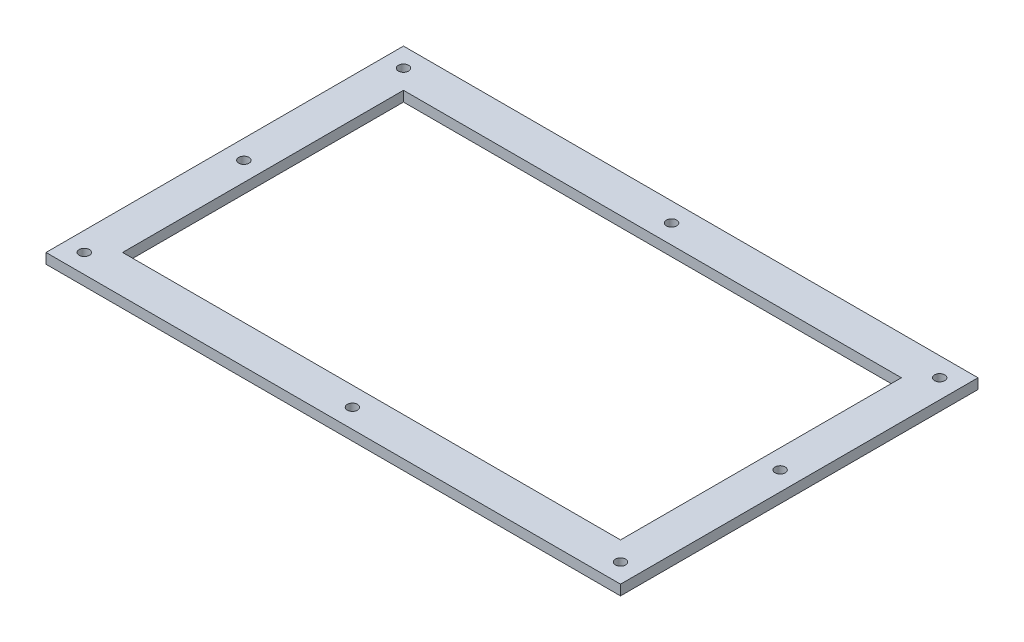
ISO-10303-21;
HEADER;
FILE_DESCRIPTION(('STEP AP214'),'2;1');
FILE_NAME('part.step','',(''),(''),'','','');
FILE_SCHEMA(('AUTOMOTIVE_DESIGN { 1 0 10303 214 1 1 1 1 }'));
ENDSEC;
DATA;
#1=APPLICATION_CONTEXT('core data for automotive mechanical design processes');
#2=APPLICATION_PROTOCOL_DEFINITION('international standard','automotive_design',2000,#1);
#3=PRODUCT_CONTEXT('',#1,'mechanical');
#4=PRODUCT('Part','Part','',(#3));
#5=PRODUCT_RELATED_PRODUCT_CATEGORY('part','',(#4));
#6=PRODUCT_DEFINITION_FORMATION('','',#4);
#7=PRODUCT_DEFINITION_CONTEXT('part definition',#1,'design');
#8=PRODUCT_DEFINITION('design','',#6,#7);
#9=PRODUCT_DEFINITION_SHAPE('','',#8);
#10=(LENGTH_UNIT() NAMED_UNIT(*) SI_UNIT(.MILLI.,.METRE.));
#11=(NAMED_UNIT(*) PLANE_ANGLE_UNIT() SI_UNIT($,.RADIAN.));
#12=(NAMED_UNIT(*) SI_UNIT($,.STERADIAN.) SOLID_ANGLE_UNIT());
#13=UNCERTAINTY_MEASURE_WITH_UNIT(LENGTH_MEASURE(1.E-05),#10,'distance_accuracy_value','');
#14=(GEOMETRIC_REPRESENTATION_CONTEXT(3) GLOBAL_UNCERTAINTY_ASSIGNED_CONTEXT((#13)) GLOBAL_UNIT_ASSIGNED_CONTEXT((#10,
#11,#12)) REPRESENTATION_CONTEXT('',''));
#15=CARTESIAN_POINT('',(0.,0.,0.));
#16=DIRECTION('',(0.,0.,1.));
#17=DIRECTION('',(1.,0.,0.));
#18=AXIS2_PLACEMENT_3D('',#15,#16,#17);
#19=CARTESIAN_POINT('',(0.,4.,0.));
#20=DIRECTION('',(0.,-1.,0.));
#21=DIRECTION('',(0.,0.,-1.));
#22=AXIS2_PLACEMENT_3D('',#19,#20,#21);
#23=PLANE('',#22);
#24=CARTESIAN_POINT('',(27.5,4.,-62.5));
#25=DIRECTION('',(0.,1.,0.));
#26=DIRECTION('',(0.,0.,1.));
#27=AXIS2_PLACEMENT_3D('',#24,#25,#26);
#28=CIRCLE('',#27,2.);
#29=CARTESIAN_POINT('',(27.5,4.,-60.5));
#30=VERTEX_POINT('',#29);
#31=EDGE_CURVE('E281',#30,#30,#28,.T.);
#32=ORIENTED_EDGE('',*,*,#31,.F.);
#33=EDGE_LOOP('',(#32));
#34=FACE_BOUND('',#33,.T.);
#35=DIRECTION('',(0.,0.,1.));
#36=VECTOR('',#35,1.);
#37=CARTESIAN_POINT('',(-85.,4.,70.));
#38=LINE('',#37,#36);
#39=CARTESIAN_POINT('',(-85.,4.,-70.));
#40=VERTEX_POINT('',#39);
#41=CARTESIAN_POINT('',(-85.,4.,70.));
#42=VERTEX_POINT('',#41);
#43=EDGE_CURVE('E268',#40,#42,#38,.T.);
#44=ORIENTED_EDGE('',*,*,#43,.T.);
#45=DIRECTION('',(1.,0.,0.));
#46=VECTOR('',#45,1.);
#47=CARTESIAN_POINT('',(-85.,4.,70.));
#48=LINE('',#47,#46);
#49=CARTESIAN_POINT('',(140.,4.,70.));
#50=VERTEX_POINT('',#49);
#51=EDGE_CURVE('E293',#42,#50,#48,.T.);
#52=ORIENTED_EDGE('',*,*,#51,.T.);
#53=DIRECTION('',(0.,0.,-1.));
#54=VECTOR('',#53,1.);
#55=CARTESIAN_POINT('',(140.,4.,70.));
#56=LINE('',#55,#54);
#57=CARTESIAN_POINT('',(140.,4.,-70.));
#58=VERTEX_POINT('',#57);
#59=EDGE_CURVE('E260',#50,#58,#56,.T.);
#60=ORIENTED_EDGE('',*,*,#59,.T.);
#61=DIRECTION('',(-1.,0.,0.));
#62=VECTOR('',#61,1.);
#63=CARTESIAN_POINT('',(-85.,4.,-70.));
#64=LINE('',#63,#62);
#65=EDGE_CURVE('E302',#58,#40,#64,.T.);
#66=ORIENTED_EDGE('',*,*,#65,.T.);
#67=EDGE_LOOP('',(#44,#52,#60,#66));
#68=FACE_BOUND('',#67,.T.);
#69=DIRECTION('',(0.,0.,1.));
#70=VECTOR('',#69,1.);
#71=CARTESIAN_POINT('',(-70.,4.,-55.));
#72=LINE('',#71,#70);
#73=CARTESIAN_POINT('',(-70.,4.,-55.));
#74=VERTEX_POINT('',#73);
#75=CARTESIAN_POINT('',(-70.,4.,55.));
#76=VERTEX_POINT('',#75);
#77=EDGE_CURVE('E106',#74,#76,#72,.T.);
#78=ORIENTED_EDGE('',*,*,#77,.F.);
#79=DIRECTION('',(-1.,0.,0.));
#80=VECTOR('',#79,1.);
#81=CARTESIAN_POINT('',(-70.,4.,-55.));
#82=LINE('',#81,#80);
#83=CARTESIAN_POINT('',(125.,4.,-55.));
#84=VERTEX_POINT('',#83);
#85=EDGE_CURVE('E133',#84,#74,#82,.T.);
#86=ORIENTED_EDGE('',*,*,#85,.F.);
#87=DIRECTION('',(0.,0.,-1.));
#88=VECTOR('',#87,1.);
#89=CARTESIAN_POINT('',(125.,4.,-55.));
#90=LINE('',#89,#88);
#91=CARTESIAN_POINT('',(125.,4.,55.));
#92=VERTEX_POINT('',#91);
#93=EDGE_CURVE('E129',#92,#84,#90,.T.);
#94=ORIENTED_EDGE('',*,*,#93,.F.);
#95=DIRECTION('',(1.,0.,0.));
#96=VECTOR('',#95,1.);
#97=CARTESIAN_POINT('',(-70.,4.,55.));
#98=LINE('',#97,#96);
#99=EDGE_CURVE('E115',#76,#92,#98,.T.);
#100=ORIENTED_EDGE('',*,*,#99,.F.);
#101=EDGE_LOOP('',(#78,#86,#94,#100));
#102=FACE_BOUND('',#101,.T.);
#103=CARTESIAN_POINT('',(132.5,4.,-62.5));
#104=DIRECTION('',(0.,1.,0.));
#105=DIRECTION('',(0.,0.,1.));
#106=AXIS2_PLACEMENT_3D('',#103,#104,#105);
#107=CIRCLE('',#106,2.);
#108=CARTESIAN_POINT('',(132.5,4.,-60.5));
#109=VERTEX_POINT('',#108);
#110=EDGE_CURVE('E148',#109,#109,#107,.T.);
#111=ORIENTED_EDGE('',*,*,#110,.F.);
#112=EDGE_LOOP('',(#111));
#113=FACE_BOUND('',#112,.T.);
#114=CARTESIAN_POINT('',(-77.5,4.,0.));
#115=DIRECTION('',(0.,1.,0.));
#116=DIRECTION('',(0.,0.,1.));
#117=AXIS2_PLACEMENT_3D('',#114,#115,#116);
#118=CIRCLE('',#117,2.);
#119=CARTESIAN_POINT('',(-77.5,4.,2.));
#120=VERTEX_POINT('',#119);
#121=EDGE_CURVE('E157',#120,#120,#118,.T.);
#122=ORIENTED_EDGE('',*,*,#121,.F.);
#123=EDGE_LOOP('',(#122));
#124=FACE_BOUND('',#123,.T.);
#125=CARTESIAN_POINT('',(-77.5,4.,62.5));
#126=DIRECTION('',(0.,1.,0.));
#127=DIRECTION('',(0.,0.,1.));
#128=AXIS2_PLACEMENT_3D('',#125,#126,#127);
#129=CIRCLE('',#128,2.);
#130=CARTESIAN_POINT('',(-77.5,4.,64.5));
#131=VERTEX_POINT('',#130);
#132=EDGE_CURVE('E166',#131,#131,#129,.T.);
#133=ORIENTED_EDGE('',*,*,#132,.F.);
#134=EDGE_LOOP('',(#133));
#135=FACE_BOUND('',#134,.T.);
#136=CARTESIAN_POINT('',(132.5,4.,62.5));
#137=DIRECTION('',(0.,1.,0.));
#138=DIRECTION('',(0.,0.,1.));
#139=AXIS2_PLACEMENT_3D('',#136,#137,#138);
#140=CIRCLE('',#139,2.);
#141=CARTESIAN_POINT('',(132.5,4.,64.5));
#142=VERTEX_POINT('',#141);
#143=EDGE_CURVE('E173',#142,#142,#140,.T.);
#144=ORIENTED_EDGE('',*,*,#143,.F.);
#145=EDGE_LOOP('',(#144));
#146=FACE_BOUND('',#145,.T.);
#147=CARTESIAN_POINT('',(132.5,4.,0.));
#148=DIRECTION('',(0.,1.,0.));
#149=DIRECTION('',(0.,0.,1.));
#150=AXIS2_PLACEMENT_3D('',#147,#148,#149);
#151=CIRCLE('',#150,2.);
#152=CARTESIAN_POINT('',(132.5,4.,2.));
#153=VERTEX_POINT('',#152);
#154=EDGE_CURVE('E190',#153,#153,#151,.T.);
#155=ORIENTED_EDGE('',*,*,#154,.F.);
#156=EDGE_LOOP('',(#155));
#157=FACE_BOUND('',#156,.T.);
#158=CARTESIAN_POINT('',(27.5,4.,62.5));
#159=DIRECTION('',(0.,1.,0.));
#160=DIRECTION('',(0.,0.,1.));
#161=AXIS2_PLACEMENT_3D('',#158,#159,#160);
#162=CIRCLE('',#161,2.);
#163=CARTESIAN_POINT('',(27.5,4.,64.5));
#164=VERTEX_POINT('',#163);
#165=EDGE_CURVE('E191',#164,#164,#162,.T.);
#166=ORIENTED_EDGE('',*,*,#165,.F.);
#167=EDGE_LOOP('',(#166));
#168=FACE_BOUND('',#167,.T.);
#169=CARTESIAN_POINT('',(-77.5,4.,-62.5));
#170=DIRECTION('',(0.,1.,0.));
#171=DIRECTION('',(0.,0.,1.));
#172=AXIS2_PLACEMENT_3D('',#169,#170,#171);
#173=CIRCLE('',#172,2.);
#174=CARTESIAN_POINT('',(-77.5,4.,-60.5));
#175=VERTEX_POINT('',#174);
#176=EDGE_CURVE('E200',#175,#175,#173,.T.);
#177=ORIENTED_EDGE('',*,*,#176,.F.);
#178=EDGE_LOOP('',(#177));
#179=FACE_BOUND('',#178,.T.);
#180=ADVANCED_FACE('F40',(#34,#68,#102,#113,#124,#135,#146,#157,#168,#179),#23,.F.);
#181=CARTESIAN_POINT('',(0.,0.,0.));
#182=DIRECTION('',(0.,-1.,0.));
#183=DIRECTION('',(0.,0.,-1.));
#184=AXIS2_PLACEMENT_3D('',#181,#182,#183);
#185=PLANE('',#184);
#186=CARTESIAN_POINT('',(27.5,0.,62.5));
#187=DIRECTION('',(0.,1.,0.));
#188=DIRECTION('',(0.,0.,1.));
#189=AXIS2_PLACEMENT_3D('',#186,#187,#188);
#190=CIRCLE('',#189,2.);
#191=CARTESIAN_POINT('',(27.5,0.,64.5));
#192=VERTEX_POINT('',#191);
#193=EDGE_CURVE('E196',#192,#192,#190,.T.);
#194=ORIENTED_EDGE('',*,*,#193,.T.);
#195=EDGE_LOOP('',(#194));
#196=FACE_BOUND('',#195,.T.);
#197=CARTESIAN_POINT('',(132.5,0.,62.5));
#198=DIRECTION('',(0.,1.,0.));
#199=DIRECTION('',(0.,0.,1.));
#200=AXIS2_PLACEMENT_3D('',#197,#198,#199);
#201=CIRCLE('',#200,2.);
#202=CARTESIAN_POINT('',(132.5,0.,64.5));
#203=VERTEX_POINT('',#202);
#204=EDGE_CURVE('E178',#203,#203,#201,.T.);
#205=ORIENTED_EDGE('',*,*,#204,.T.);
#206=EDGE_LOOP('',(#205));
#207=FACE_BOUND('',#206,.T.);
#208=CARTESIAN_POINT('',(-77.5,0.,0.));
#209=DIRECTION('',(0.,1.,0.));
#210=DIRECTION('',(0.,0.,1.));
#211=AXIS2_PLACEMENT_3D('',#208,#209,#210);
#212=CIRCLE('',#211,2.);
#213=CARTESIAN_POINT('',(-77.5,0.,2.));
#214=VERTEX_POINT('',#213);
#215=EDGE_CURVE('E154',#214,#214,#212,.T.);
#216=ORIENTED_EDGE('',*,*,#215,.T.);
#217=EDGE_LOOP('',(#216));
#218=FACE_BOUND('',#217,.T.);
#219=DIRECTION('',(-1.,0.,0.));
#220=VECTOR('',#219,1.);
#221=CARTESIAN_POINT('',(-70.,0.,-55.));
#222=LINE('',#221,#220);
#223=CARTESIAN_POINT('',(125.,0.,-55.));
#224=VERTEX_POINT('',#223);
#225=CARTESIAN_POINT('',(-70.,0.,-55.));
#226=VERTEX_POINT('',#225);
#227=EDGE_CURVE('E116',#224,#226,#222,.T.);
#228=ORIENTED_EDGE('',*,*,#227,.T.);
#229=DIRECTION('',(0.,0.,1.));
#230=VECTOR('',#229,1.);
#231=CARTESIAN_POINT('',(-70.,0.,-55.));
#232=LINE('',#231,#230);
#233=CARTESIAN_POINT('',(-70.,0.,55.));
#234=VERTEX_POINT('',#233);
#235=EDGE_CURVE('E64',#226,#234,#232,.T.);
#236=ORIENTED_EDGE('',*,*,#235,.T.);
#237=DIRECTION('',(1.,0.,0.));
#238=VECTOR('',#237,1.);
#239=CARTESIAN_POINT('',(-70.,0.,55.));
#240=LINE('',#239,#238);
#241=CARTESIAN_POINT('',(125.,0.,55.));
#242=VERTEX_POINT('',#241);
#243=EDGE_CURVE('E122',#234,#242,#240,.T.);
#244=ORIENTED_EDGE('',*,*,#243,.T.);
#245=DIRECTION('',(0.,0.,-1.));
#246=VECTOR('',#245,1.);
#247=CARTESIAN_POINT('',(125.,0.,-55.));
#248=LINE('',#247,#246);
#249=EDGE_CURVE('E325',#242,#224,#248,.T.);
#250=ORIENTED_EDGE('',*,*,#249,.T.);
#251=EDGE_LOOP('',(#228,#236,#244,#250));
#252=FACE_BOUND('',#251,.T.);
#253=CARTESIAN_POINT('',(27.5,0.,-62.5));
#254=DIRECTION('',(0.,1.,0.));
#255=DIRECTION('',(0.,0.,1.));
#256=AXIS2_PLACEMENT_3D('',#253,#254,#255);
#257=CIRCLE('',#256,2.);
#258=CARTESIAN_POINT('',(27.5,0.,-60.5));
#259=VERTEX_POINT('',#258);
#260=EDGE_CURVE('E124',#259,#259,#257,.T.);
#261=ORIENTED_EDGE('',*,*,#260,.T.);
#262=EDGE_LOOP('',(#261));
#263=FACE_BOUND('',#262,.T.);
#264=DIRECTION('',(0.,0.,1.));
#265=VECTOR('',#264,1.);
#266=CARTESIAN_POINT('',(-85.,0.,70.));
#267=LINE('',#266,#265);
#268=CARTESIAN_POINT('',(-85.,0.,-70.));
#269=VERTEX_POINT('',#268);
#270=CARTESIAN_POINT('',(-85.,0.,70.));
#271=VERTEX_POINT('',#270);
#272=EDGE_CURVE('E256',#269,#271,#267,.T.);
#273=ORIENTED_EDGE('',*,*,#272,.F.);
#274=DIRECTION('',(-1.,0.,0.));
#275=VECTOR('',#274,1.);
#276=CARTESIAN_POINT('',(-85.,0.,-70.));
#277=LINE('',#276,#275);
#278=CARTESIAN_POINT('',(140.,0.,-70.));
#279=VERTEX_POINT('',#278);
#280=EDGE_CURVE('E264',#279,#269,#277,.T.);
#281=ORIENTED_EDGE('',*,*,#280,.F.);
#282=DIRECTION('',(0.,0.,-1.));
#283=VECTOR('',#282,1.);
#284=CARTESIAN_POINT('',(140.,0.,70.));
#285=LINE('',#284,#283);
#286=CARTESIAN_POINT('',(140.,0.,70.));
#287=VERTEX_POINT('',#286);
#288=EDGE_CURVE('E255',#287,#279,#285,.T.);
#289=ORIENTED_EDGE('',*,*,#288,.F.);
#290=DIRECTION('',(1.,0.,0.));
#291=VECTOR('',#290,1.);
#292=CARTESIAN_POINT('',(-85.,0.,70.));
#293=LINE('',#292,#291);
#294=EDGE_CURVE('E246',#271,#287,#293,.T.);
#295=ORIENTED_EDGE('',*,*,#294,.F.);
#296=EDGE_LOOP('',(#273,#281,#289,#295));
#297=FACE_BOUND('',#296,.T.);
#298=CARTESIAN_POINT('',(132.5,0.,-62.5));
#299=DIRECTION('',(0.,1.,0.));
#300=DIRECTION('',(0.,0.,1.));
#301=AXIS2_PLACEMENT_3D('',#298,#299,#300);
#302=CIRCLE('',#301,2.);
#303=CARTESIAN_POINT('',(132.5,0.,-60.5));
#304=VERTEX_POINT('',#303);
#305=EDGE_CURVE('E153',#304,#304,#302,.T.);
#306=ORIENTED_EDGE('',*,*,#305,.T.);
#307=EDGE_LOOP('',(#306));
#308=FACE_BOUND('',#307,.T.);
#309=CARTESIAN_POINT('',(-77.5,0.,62.5));
#310=DIRECTION('',(0.,1.,0.));
#311=DIRECTION('',(0.,0.,1.));
#312=AXIS2_PLACEMENT_3D('',#309,#310,#311);
#313=CIRCLE('',#312,2.);
#314=CARTESIAN_POINT('',(-77.5,0.,64.5));
#315=VERTEX_POINT('',#314);
#316=EDGE_CURVE('E169',#315,#315,#313,.T.);
#317=ORIENTED_EDGE('',*,*,#316,.T.);
#318=EDGE_LOOP('',(#317));
#319=FACE_BOUND('',#318,.T.);
#320=CARTESIAN_POINT('',(132.5,0.,0.));
#321=DIRECTION('',(0.,1.,0.));
#322=DIRECTION('',(0.,0.,1.));
#323=AXIS2_PLACEMENT_3D('',#320,#321,#322);
#324=CIRCLE('',#323,2.);
#325=CARTESIAN_POINT('',(132.5,0.,2.));
#326=VERTEX_POINT('',#325);
#327=EDGE_CURVE('E187',#326,#326,#324,.T.);
#328=ORIENTED_EDGE('',*,*,#327,.T.);
#329=EDGE_LOOP('',(#328));
#330=FACE_BOUND('',#329,.T.);
#331=CARTESIAN_POINT('',(-77.5,0.,-62.5));
#332=DIRECTION('',(0.,1.,0.));
#333=DIRECTION('',(0.,0.,1.));
#334=AXIS2_PLACEMENT_3D('',#331,#332,#333);
#335=CIRCLE('',#334,2.);
#336=CARTESIAN_POINT('',(-77.5,0.,-60.5));
#337=VERTEX_POINT('',#336);
#338=EDGE_CURVE('E205',#337,#337,#335,.T.);
#339=ORIENTED_EDGE('',*,*,#338,.T.);
#340=EDGE_LOOP('',(#339));
#341=FACE_BOUND('',#340,.T.);
#342=ADVANCED_FACE('F217',(#196,#207,#218,#252,#263,#297,#308,#319,#330,#341),#185,.T.);
#343=CARTESIAN_POINT('',(-85.,4.,70.));
#344=DIRECTION('',(1.,0.,0.));
#345=DIRECTION('',(0.,0.,-1.));
#346=AXIS2_PLACEMENT_3D('',#343,#344,#345);
#347=PLANE('',#346);
#348=ORIENTED_EDGE('',*,*,#272,.T.);
#349=DIRECTION('',(0.,-1.,0.));
#350=VECTOR('',#349,1.);
#351=CARTESIAN_POINT('',(-85.,4.,70.));
#352=LINE('',#351,#350);
#353=EDGE_CURVE('E12',#42,#271,#352,.T.);
#354=ORIENTED_EDGE('',*,*,#353,.F.);
#355=ORIENTED_EDGE('',*,*,#43,.F.);
#356=DIRECTION('',(0.,-1.,0.));
#357=VECTOR('',#356,1.);
#358=CARTESIAN_POINT('',(-85.,4.,-70.));
#359=LINE('',#358,#357);
#360=EDGE_CURVE('E273',#40,#269,#359,.T.);
#361=ORIENTED_EDGE('',*,*,#360,.T.);
#362=EDGE_LOOP('',(#348,#354,#355,#361));
#363=FACE_BOUND('',#362,.T.);
#364=ADVANCED_FACE('F42',(#363),#347,.F.);
#365=CARTESIAN_POINT('',(-85.,4.,70.));
#366=DIRECTION('',(0.,0.,-1.));
#367=DIRECTION('',(-1.,0.,0.));
#368=AXIS2_PLACEMENT_3D('',#365,#366,#367);
#369=PLANE('',#368);
#370=ORIENTED_EDGE('',*,*,#294,.T.);
#371=DIRECTION('',(0.,-1.,0.));
#372=VECTOR('',#371,1.);
#373=CARTESIAN_POINT('',(140.,4.,70.));
#374=LINE('',#373,#372);
#375=EDGE_CURVE('E49',#50,#287,#374,.T.);
#376=ORIENTED_EDGE('',*,*,#375,.F.);
#377=ORIENTED_EDGE('',*,*,#51,.F.);
#378=ORIENTED_EDGE('',*,*,#353,.T.);
#379=EDGE_LOOP('',(#370,#376,#377,#378));
#380=FACE_BOUND('',#379,.T.);
#381=ADVANCED_FACE('F237',(#380),#369,.F.);
#382=CARTESIAN_POINT('',(140.,4.,70.));
#383=DIRECTION('',(-1.,0.,0.));
#384=DIRECTION('',(0.,0.,1.));
#385=AXIS2_PLACEMENT_3D('',#382,#383,#384);
#386=PLANE('',#385);
#387=ORIENTED_EDGE('',*,*,#288,.T.);
#388=DIRECTION('',(0.,-1.,0.));
#389=VECTOR('',#388,1.);
#390=CARTESIAN_POINT('',(140.,4.,-70.));
#391=LINE('',#390,#389);
#392=EDGE_CURVE('E262',#58,#279,#391,.T.);
#393=ORIENTED_EDGE('',*,*,#392,.F.);
#394=ORIENTED_EDGE('',*,*,#59,.F.);
#395=ORIENTED_EDGE('',*,*,#375,.T.);
#396=EDGE_LOOP('',(#387,#393,#394,#395));
#397=FACE_BOUND('',#396,.T.);
#398=ADVANCED_FACE('F234',(#397),#386,.F.);
#399=CARTESIAN_POINT('',(-85.,4.,-70.));
#400=DIRECTION('',(0.,0.,1.));
#401=DIRECTION('',(1.,0.,0.));
#402=AXIS2_PLACEMENT_3D('',#399,#400,#401);
#403=PLANE('',#402);
#404=ORIENTED_EDGE('',*,*,#280,.T.);
#405=ORIENTED_EDGE('',*,*,#360,.F.);
#406=ORIENTED_EDGE('',*,*,#65,.F.);
#407=ORIENTED_EDGE('',*,*,#392,.T.);
#408=EDGE_LOOP('',(#404,#405,#406,#407));
#409=FACE_BOUND('',#408,.T.);
#410=ADVANCED_FACE('F231',(#409),#403,.F.);
#411=CARTESIAN_POINT('',(27.5,4.,-62.5));
#412=DIRECTION('',(0.,-1.,0.));
#413=DIRECTION('',(0.,0.,-1.));
#414=AXIS2_PLACEMENT_3D('',#411,#412,#413);
#415=CYLINDRICAL_SURFACE('',#414,2.);
#416=ORIENTED_EDGE('',*,*,#31,.T.);
#417=EDGE_LOOP('',(#416));
#418=FACE_BOUND('',#417,.T.);
#419=ORIENTED_EDGE('',*,*,#260,.F.);
#420=EDGE_LOOP('',(#419));
#421=FACE_BOUND('',#420,.T.);
#422=ADVANCED_FACE('F228',(#418,#421),#415,.F.);
#423=CARTESIAN_POINT('',(-70.,4.,-55.));
#424=DIRECTION('',(1.,0.,0.));
#425=DIRECTION('',(0.,0.,-1.));
#426=AXIS2_PLACEMENT_3D('',#423,#424,#425);
#427=PLANE('',#426);
#428=ORIENTED_EDGE('',*,*,#235,.F.);
#429=DIRECTION('',(0.,-1.,0.));
#430=VECTOR('',#429,1.);
#431=CARTESIAN_POINT('',(-70.,4.,-55.));
#432=LINE('',#431,#430);
#433=EDGE_CURVE('E110',#74,#226,#432,.T.);
#434=ORIENTED_EDGE('',*,*,#433,.F.);
#435=ORIENTED_EDGE('',*,*,#77,.T.);
#436=DIRECTION('',(0.,-1.,0.));
#437=VECTOR('',#436,1.);
#438=CARTESIAN_POINT('',(-70.,4.,55.));
#439=LINE('',#438,#437);
#440=EDGE_CURVE('E109',#76,#234,#439,.T.);
#441=ORIENTED_EDGE('',*,*,#440,.T.);
#442=EDGE_LOOP('',(#428,#434,#435,#441));
#443=FACE_BOUND('',#442,.T.);
#444=ADVANCED_FACE('F108',(#443),#427,.T.);
#445=CARTESIAN_POINT('',(-70.,4.,55.));
#446=DIRECTION('',(0.,0.,-1.));
#447=DIRECTION('',(-1.,0.,0.));
#448=AXIS2_PLACEMENT_3D('',#445,#446,#447);
#449=PLANE('',#448);
#450=ORIENTED_EDGE('',*,*,#243,.F.);
#451=ORIENTED_EDGE('',*,*,#440,.F.);
#452=ORIENTED_EDGE('',*,*,#99,.T.);
#453=DIRECTION('',(0.,-1.,0.));
#454=VECTOR('',#453,1.);
#455=CARTESIAN_POINT('',(125.,4.,55.));
#456=LINE('',#455,#454);
#457=EDGE_CURVE('E125',#92,#242,#456,.T.);
#458=ORIENTED_EDGE('',*,*,#457,.T.);
#459=EDGE_LOOP('',(#450,#451,#452,#458));
#460=FACE_BOUND('',#459,.T.);
#461=ADVANCED_FACE('F119',(#460),#449,.T.);
#462=CARTESIAN_POINT('',(125.,4.,-55.));
#463=DIRECTION('',(-1.,0.,0.));
#464=DIRECTION('',(0.,0.,1.));
#465=AXIS2_PLACEMENT_3D('',#462,#463,#464);
#466=PLANE('',#465);
#467=ORIENTED_EDGE('',*,*,#249,.F.);
#468=ORIENTED_EDGE('',*,*,#457,.F.);
#469=ORIENTED_EDGE('',*,*,#93,.T.);
#470=DIRECTION('',(0.,-1.,0.));
#471=VECTOR('',#470,1.);
#472=CARTESIAN_POINT('',(125.,4.,-55.));
#473=LINE('',#472,#471);
#474=EDGE_CURVE('E56',#84,#224,#473,.T.);
#475=ORIENTED_EDGE('',*,*,#474,.T.);
#476=EDGE_LOOP('',(#467,#468,#469,#475));
#477=FACE_BOUND('',#476,.T.);
#478=ADVANCED_FACE('F337',(#477),#466,.T.);
#479=CARTESIAN_POINT('',(-70.,4.,-55.));
#480=DIRECTION('',(0.,0.,1.));
#481=DIRECTION('',(1.,0.,0.));
#482=AXIS2_PLACEMENT_3D('',#479,#480,#481);
#483=PLANE('',#482);
#484=ORIENTED_EDGE('',*,*,#227,.F.);
#485=ORIENTED_EDGE('',*,*,#474,.F.);
#486=ORIENTED_EDGE('',*,*,#85,.T.);
#487=ORIENTED_EDGE('',*,*,#433,.T.);
#488=EDGE_LOOP('',(#484,#485,#486,#487));
#489=FACE_BOUND('',#488,.T.);
#490=ADVANCED_FACE('F334',(#489),#483,.T.);
#491=CARTESIAN_POINT('',(132.5,4.,-62.5));
#492=DIRECTION('',(0.,-1.,0.));
#493=DIRECTION('',(0.,0.,-1.));
#494=AXIS2_PLACEMENT_3D('',#491,#492,#493);
#495=CYLINDRICAL_SURFACE('',#494,2.);
#496=ORIENTED_EDGE('',*,*,#110,.T.);
#497=EDGE_LOOP('',(#496));
#498=FACE_BOUND('',#497,.T.);
#499=ORIENTED_EDGE('',*,*,#305,.F.);
#500=EDGE_LOOP('',(#499));
#501=FACE_BOUND('',#500,.T.);
#502=ADVANCED_FACE('F336',(#498,#501),#495,.F.);
#503=CARTESIAN_POINT('',(-77.5,4.,0.));
#504=DIRECTION('',(0.,-1.,0.));
#505=DIRECTION('',(0.,0.,-1.));
#506=AXIS2_PLACEMENT_3D('',#503,#504,#505);
#507=CYLINDRICAL_SURFACE('',#506,2.);
#508=ORIENTED_EDGE('',*,*,#121,.T.);
#509=EDGE_LOOP('',(#508));
#510=FACE_BOUND('',#509,.T.);
#511=ORIENTED_EDGE('',*,*,#215,.F.);
#512=EDGE_LOOP('',(#511));
#513=FACE_BOUND('',#512,.T.);
#514=ADVANCED_FACE('F343',(#510,#513),#507,.F.);
#515=CARTESIAN_POINT('',(-77.5,4.,62.5));
#516=DIRECTION('',(0.,-1.,0.));
#517=DIRECTION('',(0.,0.,-1.));
#518=AXIS2_PLACEMENT_3D('',#515,#516,#517);
#519=CYLINDRICAL_SURFACE('',#518,2.);
#520=ORIENTED_EDGE('',*,*,#132,.T.);
#521=EDGE_LOOP('',(#520));
#522=FACE_BOUND('',#521,.T.);
#523=ORIENTED_EDGE('',*,*,#316,.F.);
#524=EDGE_LOOP('',(#523));
#525=FACE_BOUND('',#524,.T.);
#526=ADVANCED_FACE('F425',(#522,#525),#519,.F.);
#527=CARTESIAN_POINT('',(132.5,4.,62.5));
#528=DIRECTION('',(0.,-1.,0.));
#529=DIRECTION('',(0.,0.,-1.));
#530=AXIS2_PLACEMENT_3D('',#527,#528,#529);
#531=CYLINDRICAL_SURFACE('',#530,2.);
#532=ORIENTED_EDGE('',*,*,#143,.T.);
#533=EDGE_LOOP('',(#532));
#534=FACE_BOUND('',#533,.T.);
#535=ORIENTED_EDGE('',*,*,#204,.F.);
#536=EDGE_LOOP('',(#535));
#537=FACE_BOUND('',#536,.T.);
#538=ADVANCED_FACE('F432',(#534,#537),#531,.F.);
#539=CARTESIAN_POINT('',(132.5,4.,0.));
#540=DIRECTION('',(0.,-1.,0.));
#541=DIRECTION('',(0.,0.,-1.));
#542=AXIS2_PLACEMENT_3D('',#539,#540,#541);
#543=CYLINDRICAL_SURFACE('',#542,2.);
#544=ORIENTED_EDGE('',*,*,#154,.T.);
#545=EDGE_LOOP('',(#544));
#546=FACE_BOUND('',#545,.T.);
#547=ORIENTED_EDGE('',*,*,#327,.F.);
#548=EDGE_LOOP('',(#547));
#549=FACE_BOUND('',#548,.T.);
#550=ADVANCED_FACE('F441',(#546,#549),#543,.F.);
#551=CARTESIAN_POINT('',(27.5,4.,62.5));
#552=DIRECTION('',(0.,-1.,0.));
#553=DIRECTION('',(0.,0.,-1.));
#554=AXIS2_PLACEMENT_3D('',#551,#552,#553);
#555=CYLINDRICAL_SURFACE('',#554,2.);
#556=ORIENTED_EDGE('',*,*,#165,.T.);
#557=EDGE_LOOP('',(#556));
#558=FACE_BOUND('',#557,.T.);
#559=ORIENTED_EDGE('',*,*,#193,.F.);
#560=EDGE_LOOP('',(#559));
#561=FACE_BOUND('',#560,.T.);
#562=ADVANCED_FACE('F450',(#558,#561),#555,.F.);
#563=CARTESIAN_POINT('',(-77.5,4.,-62.5));
#564=DIRECTION('',(0.,-1.,0.));
#565=DIRECTION('',(0.,0.,-1.));
#566=AXIS2_PLACEMENT_3D('',#563,#564,#565);
#567=CYLINDRICAL_SURFACE('',#566,2.);
#568=ORIENTED_EDGE('',*,*,#176,.T.);
#569=EDGE_LOOP('',(#568));
#570=FACE_BOUND('',#569,.T.);
#571=ORIENTED_EDGE('',*,*,#338,.F.);
#572=EDGE_LOOP('',(#571));
#573=FACE_BOUND('',#572,.T.);
#574=ADVANCED_FACE('F213',(#570,#573),#567,.F.);
#575=CLOSED_SHELL('',(#180,#342,#364,#381,#398,#410,#422,#444,#461,#478,#490,#502,#514,#526,
#538,#550,#562,#574));
#576=MANIFOLD_SOLID_BREP('B2',#575);
#577=ADVANCED_BREP_SHAPE_REPRESENTATION('',(#18,#576),#14);
#578=SHAPE_DEFINITION_REPRESENTATION(#9,#577);
ENDSEC;
END-ISO-10303-21;
